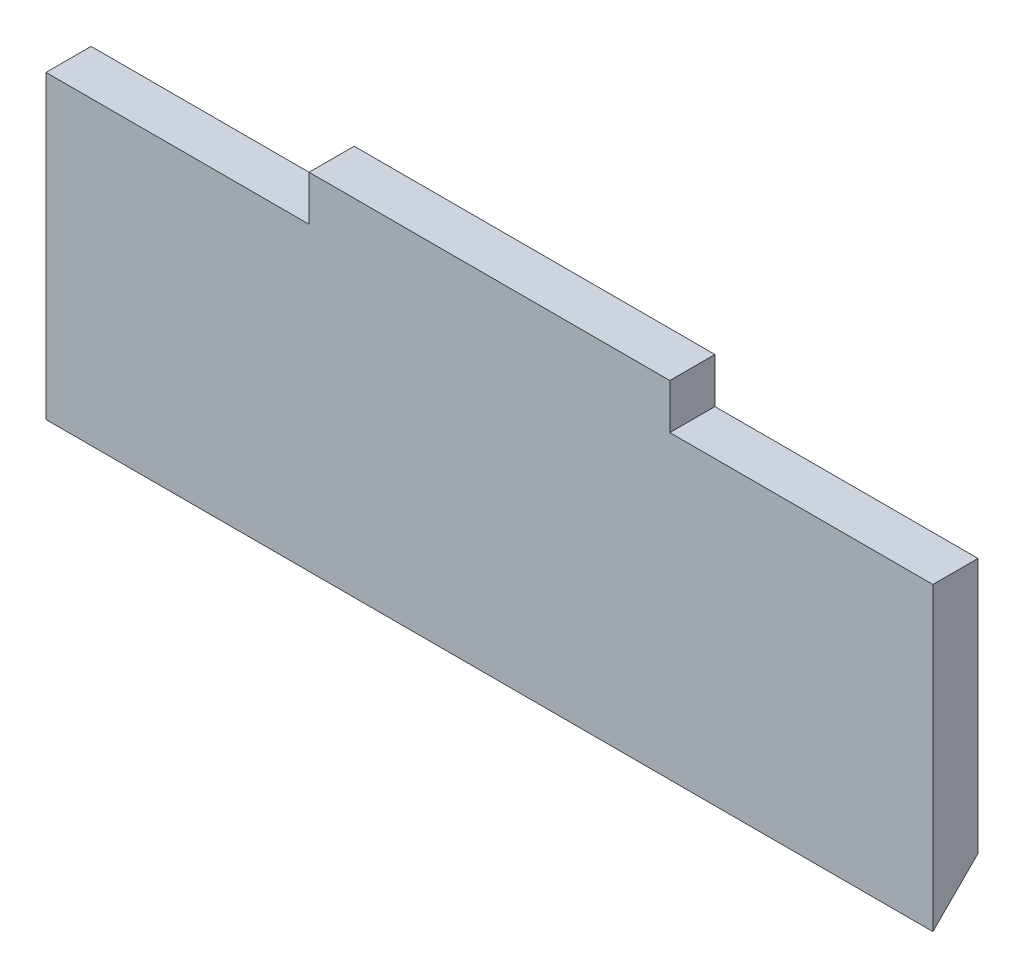
ISO-10303-21;
HEADER;
FILE_DESCRIPTION(('STEP AP214'),'2;1');
FILE_NAME('part.step','',(''),(''),'','','');
FILE_SCHEMA(('AUTOMOTIVE_DESIGN { 1 0 10303 214 1 1 1 1 }'));
ENDSEC;
DATA;
#1=APPLICATION_CONTEXT('core data for automotive mechanical design processes');
#2=APPLICATION_PROTOCOL_DEFINITION('international standard','automotive_design',2000,#1);
#3=PRODUCT_CONTEXT('',#1,'mechanical');
#4=PRODUCT('Part','Part','',(#3));
#5=PRODUCT_RELATED_PRODUCT_CATEGORY('part','',(#4));
#6=PRODUCT_DEFINITION_FORMATION('','',#4);
#7=PRODUCT_DEFINITION_CONTEXT('part definition',#1,'design');
#8=PRODUCT_DEFINITION('design','',#6,#7);
#9=PRODUCT_DEFINITION_SHAPE('','',#8);
#10=(LENGTH_UNIT() NAMED_UNIT(*) SI_UNIT(.MILLI.,.METRE.));
#11=(NAMED_UNIT(*) PLANE_ANGLE_UNIT() SI_UNIT($,.RADIAN.));
#12=(NAMED_UNIT(*) SI_UNIT($,.STERADIAN.) SOLID_ANGLE_UNIT());
#13=UNCERTAINTY_MEASURE_WITH_UNIT(LENGTH_MEASURE(1.E-05),#10,'distance_accuracy_value','');
#14=(GEOMETRIC_REPRESENTATION_CONTEXT(3) GLOBAL_UNCERTAINTY_ASSIGNED_CONTEXT((#13)) GLOBAL_UNIT_ASSIGNED_CONTEXT((#10,
#11,#12)) REPRESENTATION_CONTEXT('',''));
#15=CARTESIAN_POINT('',(0.,0.,0.));
#16=DIRECTION('',(0.,0.,1.));
#17=DIRECTION('',(1.,0.,0.));
#18=AXIS2_PLACEMENT_3D('',#15,#16,#17);
#19=CARTESIAN_POINT('',(60.,-20.,6.));
#20=DIRECTION('',(0.,1.,0.));
#21=DIRECTION('',(-1.,0.,0.));
#22=AXIS2_PLACEMENT_3D('',#19,#20,#21);
#23=PLANE('',#22);
#24=DIRECTION('',(0.,0.,-1.));
#25=VECTOR('',#24,1.);
#26=CARTESIAN_POINT('',(20.,-20.,0.));
#27=LINE('',#26,#25);
#28=CARTESIAN_POINT('',(20.,-20.,6.));
#29=VERTEX_POINT('',#28);
#30=CARTESIAN_POINT('',(20.,-20.,0.));
#31=VERTEX_POINT('',#30);
#32=EDGE_CURVE('E134',#29,#31,#27,.T.);
#33=ORIENTED_EDGE('',*,*,#32,.F.);
#34=DIRECTION('',(1.,0.,0.));
#35=VECTOR('',#34,1.);
#36=CARTESIAN_POINT('',(60.,-20.,6.));
#37=LINE('',#36,#35);
#38=CARTESIAN_POINT('',(-20.,-20.,6.));
#39=VERTEX_POINT('',#38);
#40=EDGE_CURVE('E140',#39,#29,#37,.T.);
#41=ORIENTED_EDGE('',*,*,#40,.F.);
#42=DIRECTION('',(0.,0.,1.));
#43=VECTOR('',#42,1.);
#44=CARTESIAN_POINT('',(-20.,-20.,0.));
#45=LINE('',#44,#43);
#46=CARTESIAN_POINT('',(-20.,-20.,0.));
#47=VERTEX_POINT('',#46);
#48=EDGE_CURVE('E170',#47,#39,#45,.T.);
#49=ORIENTED_EDGE('',*,*,#48,.F.);
#50=DIRECTION('',(1.,0.,0.));
#51=VECTOR('',#50,1.);
#52=CARTESIAN_POINT('',(60.,-20.,0.));
#53=LINE('',#52,#51);
#54=EDGE_CURVE('E147',#47,#31,#53,.T.);
#55=ORIENTED_EDGE('',*,*,#54,.T.);
#56=EDGE_LOOP('',(#33,#41,#49,#55));
#57=FACE_BOUND('',#56,.T.);
#58=ADVANCED_FACE('F34',(#57),#23,.F.);
#59=CARTESIAN_POINT('',(60.,20.,6.));
#60=DIRECTION('',(0.,-1.,0.));
#61=DIRECTION('',(1.,0.,0.));
#62=AXIS2_PLACEMENT_3D('',#59,#60,#61);
#63=PLANE('',#62);
#64=DIRECTION('',(-1.,0.,0.));
#65=VECTOR('',#64,1.);
#66=CARTESIAN_POINT('',(60.,20.,0.));
#67=LINE('',#66,#65);
#68=CARTESIAN_POINT('',(-24.,20.,0.));
#69=VERTEX_POINT('',#68);
#70=CARTESIAN_POINT('',(-59.,20.,0.));
#71=VERTEX_POINT('',#70);
#72=EDGE_CURVE('E141',#69,#71,#67,.T.);
#73=ORIENTED_EDGE('',*,*,#72,.T.);
#74=DIRECTION('',(0.,0.,1.));
#75=VECTOR('',#74,1.);
#76=CARTESIAN_POINT('',(-59.,20.,0.));
#77=LINE('',#76,#75);
#78=CARTESIAN_POINT('',(-59.,20.,6.));
#79=VERTEX_POINT('',#78);
#80=EDGE_CURVE('E183',#71,#79,#77,.T.);
#81=ORIENTED_EDGE('',*,*,#80,.T.);
#82=DIRECTION('',(-1.,0.,0.));
#83=VECTOR('',#82,1.);
#84=CARTESIAN_POINT('',(60.,20.,6.));
#85=LINE('',#84,#83);
#86=CARTESIAN_POINT('',(-24.,20.,6.));
#87=VERTEX_POINT('',#86);
#88=EDGE_CURVE('E152',#87,#79,#85,.T.);
#89=ORIENTED_EDGE('',*,*,#88,.F.);
#90=DIRECTION('',(0.,0.,1.));
#91=VECTOR('',#90,1.);
#92=CARTESIAN_POINT('',(-24.,20.,0.));
#93=LINE('',#92,#91);
#94=EDGE_CURVE('E189',#69,#87,#93,.T.);
#95=ORIENTED_EDGE('',*,*,#94,.F.);
#96=EDGE_LOOP('',(#73,#81,#89,#95));
#97=FACE_BOUND('',#96,.T.);
#98=ADVANCED_FACE('F229',(#97),#63,.F.);
#99=CARTESIAN_POINT('',(59.,20.,6.));
#100=VERTEX_POINT('',#99);
#101=CARTESIAN_POINT('',(24.,20.,6.));
#102=VERTEX_POINT('',#101);
#103=EDGE_CURVE('E133',#100,#102,#85,.T.);
#104=ORIENTED_EDGE('',*,*,#103,.F.);
#105=DIRECTION('',(0.,0.,1.));
#106=VECTOR('',#105,1.);
#107=CARTESIAN_POINT('',(59.,20.,0.));
#108=LINE('',#107,#106);
#109=CARTESIAN_POINT('',(59.,20.,0.));
#110=VERTEX_POINT('',#109);
#111=EDGE_CURVE('E118',#110,#100,#108,.T.);
#112=ORIENTED_EDGE('',*,*,#111,.F.);
#113=CARTESIAN_POINT('',(24.,20.,0.));
#114=VERTEX_POINT('',#113);
#115=EDGE_CURVE('E131',#110,#114,#67,.T.);
#116=ORIENTED_EDGE('',*,*,#115,.T.);
#117=DIRECTION('',(0.,0.,1.));
#118=VECTOR('',#117,1.);
#119=CARTESIAN_POINT('',(24.,20.,0.));
#120=LINE('',#119,#118);
#121=EDGE_CURVE('E200',#114,#102,#120,.T.);
#122=ORIENTED_EDGE('',*,*,#121,.T.);
#123=EDGE_LOOP('',(#104,#112,#116,#122));
#124=FACE_BOUND('',#123,.T.);
#125=ADVANCED_FACE('F129',(#124),#63,.F.);
#126=CARTESIAN_POINT('',(0.,0.,6.));
#127=DIRECTION('',(0.,0.,-1.));
#128=DIRECTION('',(-1.,0.,0.));
#129=AXIS2_PLACEMENT_3D('',#126,#127,#128);
#130=PLANE('',#129);
#131=DIRECTION('',(1.,0.,0.));
#132=VECTOR('',#131,1.);
#133=CARTESIAN_POINT('',(20.,-20.,6.));
#134=LINE('',#133,#132);
#135=CARTESIAN_POINT('',(59.,-20.,6.));
#136=VERTEX_POINT('',#135);
#137=EDGE_CURVE('E173',#29,#136,#134,.T.);
#138=ORIENTED_EDGE('',*,*,#137,.T.);
#139=DIRECTION('',(0.,-1.,0.));
#140=VECTOR('',#139,1.);
#141=CARTESIAN_POINT('',(59.,-20.,6.));
#142=LINE('',#141,#140);
#143=EDGE_CURVE('E125',#100,#136,#142,.T.);
#144=ORIENTED_EDGE('',*,*,#143,.F.);
#145=ORIENTED_EDGE('',*,*,#103,.T.);
#146=DIRECTION('',(0.,-1.,0.));
#147=VECTOR('',#146,1.);
#148=CARTESIAN_POINT('',(24.,20.,6.));
#149=LINE('',#148,#147);
#150=CARTESIAN_POINT('',(24.,26.,6.));
#151=VERTEX_POINT('',#150);
#152=EDGE_CURVE('E194',#151,#102,#149,.T.);
#153=ORIENTED_EDGE('',*,*,#152,.F.);
#154=DIRECTION('',(-1.,0.,0.));
#155=VECTOR('',#154,1.);
#156=CARTESIAN_POINT('',(-25.,26.,6.));
#157=LINE('',#156,#155);
#158=CARTESIAN_POINT('',(-24.,26.,6.));
#159=VERTEX_POINT('',#158);
#160=EDGE_CURVE('E157',#151,#159,#157,.T.);
#161=ORIENTED_EDGE('',*,*,#160,.T.);
#162=DIRECTION('',(0.,1.,0.));
#163=VECTOR('',#162,1.);
#164=CARTESIAN_POINT('',(-24.,20.,6.));
#165=LINE('',#164,#163);
#166=EDGE_CURVE('E48',#87,#159,#165,.T.);
#167=ORIENTED_EDGE('',*,*,#166,.F.);
#168=ORIENTED_EDGE('',*,*,#88,.T.);
#169=DIRECTION('',(0.,1.,0.));
#170=VECTOR('',#169,1.);
#171=CARTESIAN_POINT('',(-59.,-20.,6.));
#172=LINE('',#171,#170);
#173=CARTESIAN_POINT('',(-59.,-20.,6.));
#174=VERTEX_POINT('',#173);
#175=EDGE_CURVE('E186',#174,#79,#172,.T.);
#176=ORIENTED_EDGE('',*,*,#175,.F.);
#177=EDGE_CURVE('E144',#174,#39,#37,.T.);
#178=ORIENTED_EDGE('',*,*,#177,.T.);
#179=ORIENTED_EDGE('',*,*,#40,.T.);
#180=EDGE_LOOP('',(#138,#144,#145,#153,#161,#167,#168,#176,#178,#179));
#181=FACE_BOUND('',#180,.T.);
#182=ADVANCED_FACE('F205',(#181),#130,.F.);
#183=CARTESIAN_POINT('',(0.,0.,0.));
#184=DIRECTION('',(0.,0.,-1.));
#185=DIRECTION('',(-1.,0.,0.));
#186=AXIS2_PLACEMENT_3D('',#183,#184,#185);
#187=PLANE('',#186);
#188=DIRECTION('',(0.,-1.,0.));
#189=VECTOR('',#188,1.);
#190=CARTESIAN_POINT('',(59.,-20.,0.));
#191=LINE('',#190,#189);
#192=CARTESIAN_POINT('',(59.,-14.,0.));
#193=VERTEX_POINT('',#192);
#194=EDGE_CURVE('E115',#110,#193,#191,.T.);
#195=ORIENTED_EDGE('',*,*,#194,.T.);
#196=DIRECTION('',(1.,0.,0.));
#197=VECTOR('',#196,1.);
#198=CARTESIAN_POINT('',(20.,-14.,0.));
#199=LINE('',#198,#197);
#200=CARTESIAN_POINT('',(20.,-14.,0.));
#201=VERTEX_POINT('',#200);
#202=EDGE_CURVE('E174',#201,#193,#199,.T.);
#203=ORIENTED_EDGE('',*,*,#202,.F.);
#204=DIRECTION('',(0.,1.,0.));
#205=VECTOR('',#204,1.);
#206=CARTESIAN_POINT('',(20.,-14.,0.));
#207=LINE('',#206,#205);
#208=EDGE_CURVE('E180',#31,#201,#207,.T.);
#209=ORIENTED_EDGE('',*,*,#208,.F.);
#210=ORIENTED_EDGE('',*,*,#54,.F.);
#211=DIRECTION('',(0.,-1.,0.));
#212=VECTOR('',#211,1.);
#213=CARTESIAN_POINT('',(-20.,-14.0000000000001,0.));
#214=LINE('',#213,#212);
#215=CARTESIAN_POINT('',(-20.,-14.0000000000001,0.));
#216=VERTEX_POINT('',#215);
#217=EDGE_CURVE('E166',#216,#47,#214,.T.);
#218=ORIENTED_EDGE('',*,*,#217,.F.);
#219=DIRECTION('',(-1.,0.,0.));
#220=VECTOR('',#219,1.);
#221=CARTESIAN_POINT('',(-20.,-14.0000000000001,0.));
#222=LINE('',#221,#220);
#223=CARTESIAN_POINT('',(-59.,-14.0000000000001,0.));
#224=VERTEX_POINT('',#223);
#225=EDGE_CURVE('E161',#216,#224,#222,.T.);
#226=ORIENTED_EDGE('',*,*,#225,.T.);
#227=DIRECTION('',(0.,1.,0.));
#228=VECTOR('',#227,1.);
#229=CARTESIAN_POINT('',(-59.,-20.,0.));
#230=LINE('',#229,#228);
#231=EDGE_CURVE('E56',#224,#71,#230,.T.);
#232=ORIENTED_EDGE('',*,*,#231,.T.);
#233=ORIENTED_EDGE('',*,*,#72,.F.);
#234=DIRECTION('',(0.,1.,0.));
#235=VECTOR('',#234,1.);
#236=CARTESIAN_POINT('',(-24.,20.,0.));
#237=LINE('',#236,#235);
#238=CARTESIAN_POINT('',(-24.,26.,0.));
#239=VERTEX_POINT('',#238);
#240=EDGE_CURVE('E192',#69,#239,#237,.T.);
#241=ORIENTED_EDGE('',*,*,#240,.T.);
#242=DIRECTION('',(-1.,0.,0.));
#243=VECTOR('',#242,1.);
#244=CARTESIAN_POINT('',(-25.,26.,0.));
#245=LINE('',#244,#243);
#246=CARTESIAN_POINT('',(24.,26.,0.));
#247=VERTEX_POINT('',#246);
#248=EDGE_CURVE('E160',#247,#239,#245,.T.);
#249=ORIENTED_EDGE('',*,*,#248,.F.);
#250=DIRECTION('',(0.,-1.,0.));
#251=VECTOR('',#250,1.);
#252=CARTESIAN_POINT('',(24.,20.,0.));
#253=LINE('',#252,#251);
#254=EDGE_CURVE('E139',#247,#114,#253,.T.);
#255=ORIENTED_EDGE('',*,*,#254,.T.);
#256=ORIENTED_EDGE('',*,*,#115,.F.);
#257=EDGE_LOOP('',(#195,#203,#209,#210,#218,#226,#232,#233,#241,#249,#255,#256));
#258=FACE_BOUND('',#257,.T.);
#259=ADVANCED_FACE('F137',(#258),#187,.T.);
#260=CARTESIAN_POINT('',(-25.,26.,0.));
#261=DIRECTION('',(0.,1.,0.));
#262=DIRECTION('',(0.,0.,1.));
#263=AXIS2_PLACEMENT_3D('',#260,#261,#262);
#264=PLANE('',#263);
#265=DIRECTION('',(0.,0.,1.));
#266=VECTOR('',#265,1.);
#267=CARTESIAN_POINT('',(24.,26.,0.));
#268=LINE('',#267,#266);
#269=EDGE_CURVE('E198',#247,#151,#268,.T.);
#270=ORIENTED_EDGE('',*,*,#269,.F.);
#271=ORIENTED_EDGE('',*,*,#248,.T.);
#272=DIRECTION('',(0.,0.,1.));
#273=VECTOR('',#272,1.);
#274=CARTESIAN_POINT('',(-24.,26.,0.));
#275=LINE('',#274,#273);
#276=EDGE_CURVE('E191',#239,#159,#275,.T.);
#277=ORIENTED_EDGE('',*,*,#276,.T.);
#278=ORIENTED_EDGE('',*,*,#160,.F.);
#279=EDGE_LOOP('',(#270,#271,#277,#278));
#280=FACE_BOUND('',#279,.T.);
#281=ADVANCED_FACE('F234',(#280),#264,.T.);
#282=CARTESIAN_POINT('',(-20.,-20.,6.));
#283=DIRECTION('',(0.,0.707106781186551,0.707106781186544));
#284=DIRECTION('',(0.,-0.707106781186544,0.707106781186551));
#285=AXIS2_PLACEMENT_3D('',#282,#283,#284);
#286=PLANE('',#285);
#287=ORIENTED_EDGE('',*,*,#177,.F.);
#288=DIRECTION('',(0.,0.707106781186544,-0.707106781186551));
#289=VECTOR('',#288,1.);
#290=CARTESIAN_POINT('',(-59.,-20.,5.99999999999999));
#291=LINE('',#290,#289);
#292=EDGE_CURVE('E11',#174,#224,#291,.T.);
#293=ORIENTED_EDGE('',*,*,#292,.T.);
#294=ORIENTED_EDGE('',*,*,#225,.F.);
#295=DIRECTION('',(0.,0.707106781186544,-0.707106781186551));
#296=VECTOR('',#295,1.);
#297=CARTESIAN_POINT('',(-20.,-20.,6.));
#298=LINE('',#297,#296);
#299=EDGE_CURVE('E168',#39,#216,#298,.T.);
#300=ORIENTED_EDGE('',*,*,#299,.F.);
#301=EDGE_LOOP('',(#287,#293,#294,#300));
#302=FACE_BOUND('',#301,.T.);
#303=ADVANCED_FACE('F224',(#302),#286,.F.);
#304=CARTESIAN_POINT('',(-20.,0.,0.));
#305=DIRECTION('',(1.,0.,0.));
#306=DIRECTION('',(0.,0.,-1.));
#307=AXIS2_PLACEMENT_3D('',#304,#305,#306);
#308=PLANE('',#307);
#309=ORIENTED_EDGE('',*,*,#48,.T.);
#310=ORIENTED_EDGE('',*,*,#299,.T.);
#311=ORIENTED_EDGE('',*,*,#217,.T.);
#312=EDGE_LOOP('',(#309,#310,#311));
#313=FACE_BOUND('',#312,.T.);
#314=ADVANCED_FACE('F220',(#313),#308,.F.);
#315=CARTESIAN_POINT('',(20.,-20.,6.));
#316=DIRECTION('',(0.,0.707106781186546,0.707106781186549));
#317=DIRECTION('',(0.,-0.707106781186549,0.707106781186546));
#318=AXIS2_PLACEMENT_3D('',#315,#316,#317);
#319=PLANE('',#318);
#320=ORIENTED_EDGE('',*,*,#202,.T.);
#321=DIRECTION('',(0.,-0.707106781186549,0.707106781186546));
#322=VECTOR('',#321,1.);
#323=CARTESIAN_POINT('',(59.,-20.,6.));
#324=LINE('',#323,#322);
#325=EDGE_CURVE('E41',#193,#136,#324,.T.);
#326=ORIENTED_EDGE('',*,*,#325,.T.);
#327=ORIENTED_EDGE('',*,*,#137,.F.);
#328=DIRECTION('',(0.,-0.707106781186549,0.707106781186546));
#329=VECTOR('',#328,1.);
#330=CARTESIAN_POINT('',(20.,-20.,6.));
#331=LINE('',#330,#329);
#332=EDGE_CURVE('E176',#201,#29,#331,.T.);
#333=ORIENTED_EDGE('',*,*,#332,.F.);
#334=EDGE_LOOP('',(#320,#326,#327,#333));
#335=FACE_BOUND('',#334,.T.);
#336=ADVANCED_FACE('F208',(#335),#319,.F.);
#337=CARTESIAN_POINT('',(20.,0.,0.));
#338=DIRECTION('',(1.,0.,0.));
#339=DIRECTION('',(0.,1.,0.));
#340=AXIS2_PLACEMENT_3D('',#337,#338,#339);
#341=PLANE('',#340);
#342=ORIENTED_EDGE('',*,*,#32,.T.);
#343=ORIENTED_EDGE('',*,*,#208,.T.);
#344=ORIENTED_EDGE('',*,*,#332,.T.);
#345=EDGE_LOOP('',(#342,#343,#344));
#346=FACE_BOUND('',#345,.T.);
#347=ADVANCED_FACE('F211',(#346),#341,.T.);
#348=CARTESIAN_POINT('',(59.,-20.,0.));
#349=DIRECTION('',(-1.,0.,0.));
#350=DIRECTION('',(0.,0.,1.));
#351=AXIS2_PLACEMENT_3D('',#348,#349,#350);
#352=PLANE('',#351);
#353=ORIENTED_EDGE('',*,*,#194,.F.);
#354=ORIENTED_EDGE('',*,*,#111,.T.);
#355=ORIENTED_EDGE('',*,*,#143,.T.);
#356=ORIENTED_EDGE('',*,*,#325,.F.);
#357=EDGE_LOOP('',(#353,#354,#355,#356));
#358=FACE_BOUND('',#357,.T.);
#359=ADVANCED_FACE('F117',(#358),#352,.F.);
#360=CARTESIAN_POINT('',(-59.,-20.,0.));
#361=DIRECTION('',(1.,0.,0.));
#362=DIRECTION('',(0.,0.,-1.));
#363=AXIS2_PLACEMENT_3D('',#360,#361,#362);
#364=PLANE('',#363);
#365=ORIENTED_EDGE('',*,*,#175,.T.);
#366=ORIENTED_EDGE('',*,*,#80,.F.);
#367=ORIENTED_EDGE('',*,*,#231,.F.);
#368=ORIENTED_EDGE('',*,*,#292,.F.);
#369=EDGE_LOOP('',(#365,#366,#367,#368));
#370=FACE_BOUND('',#369,.T.);
#371=ADVANCED_FACE('F226',(#370),#364,.F.);
#372=CARTESIAN_POINT('',(24.,20.,0.));
#373=DIRECTION('',(-1.,0.,0.));
#374=DIRECTION('',(0.,0.,1.));
#375=AXIS2_PLACEMENT_3D('',#372,#373,#374);
#376=PLANE('',#375);
#377=ORIENTED_EDGE('',*,*,#152,.T.);
#378=ORIENTED_EDGE('',*,*,#121,.F.);
#379=ORIENTED_EDGE('',*,*,#254,.F.);
#380=ORIENTED_EDGE('',*,*,#269,.T.);
#381=EDGE_LOOP('',(#377,#378,#379,#380));
#382=FACE_BOUND('',#381,.T.);
#383=ADVANCED_FACE('F237',(#382),#376,.F.);
#384=CARTESIAN_POINT('',(-24.,20.,0.));
#385=DIRECTION('',(1.,0.,0.));
#386=DIRECTION('',(0.,1.,0.));
#387=AXIS2_PLACEMENT_3D('',#384,#385,#386);
#388=PLANE('',#387);
#389=ORIENTED_EDGE('',*,*,#166,.T.);
#390=ORIENTED_EDGE('',*,*,#276,.F.);
#391=ORIENTED_EDGE('',*,*,#240,.F.);
#392=ORIENTED_EDGE('',*,*,#94,.T.);
#393=EDGE_LOOP('',(#389,#390,#391,#392));
#394=FACE_BOUND('',#393,.T.);
#395=ADVANCED_FACE('F231',(#394),#388,.F.);
#396=CLOSED_SHELL('',(#58,#98,#125,#182,#259,#281,#303,#314,#336,#347,#359,#371,#383,#395));
#397=MANIFOLD_SOLID_BREP('B2',#396);
#398=ADVANCED_BREP_SHAPE_REPRESENTATION('',(#18,#397),#14);
#399=SHAPE_DEFINITION_REPRESENTATION(#9,#398);
ENDSEC;
END-ISO-10303-21;
